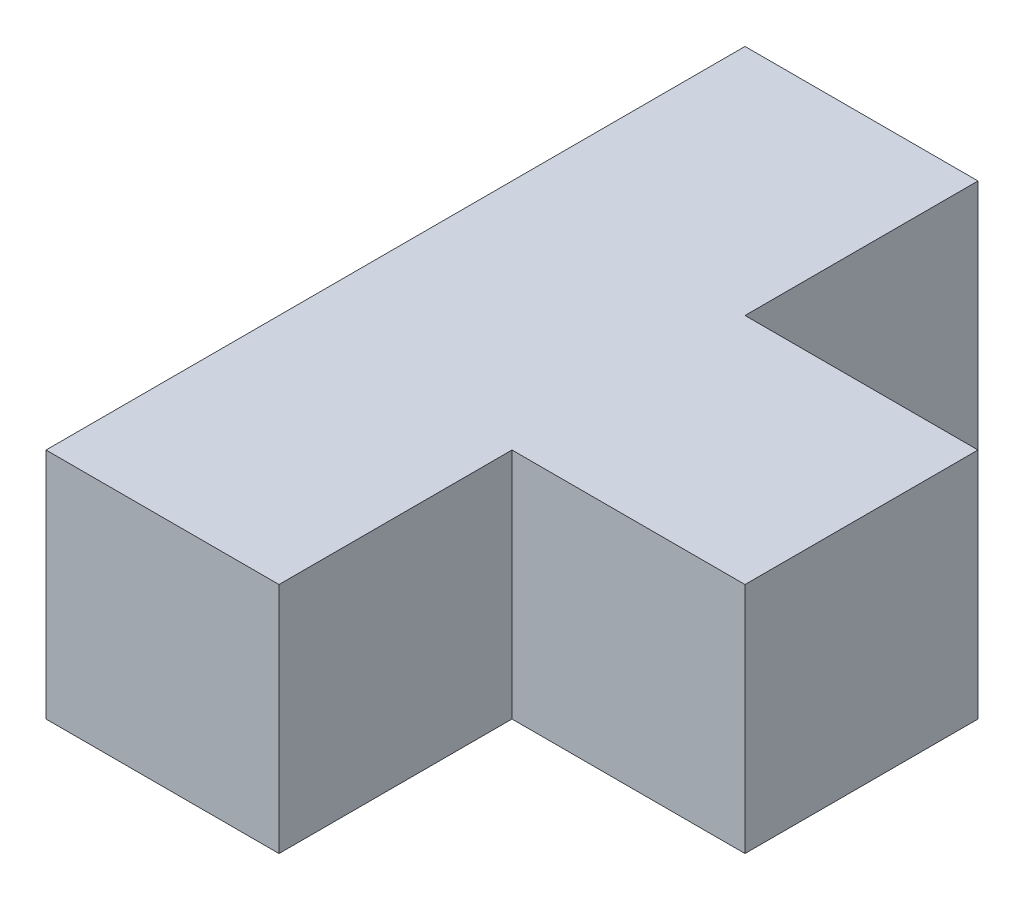
ISO-10303-21;
HEADER;
FILE_DESCRIPTION(('STEP AP214'),'2;1');
FILE_NAME('part.step','',(''),(''),'','','');
FILE_SCHEMA(('AUTOMOTIVE_DESIGN { 1 0 10303 214 1 1 1 1 }'));
ENDSEC;
DATA;
#1=APPLICATION_CONTEXT('core data for automotive mechanical design processes');
#2=APPLICATION_PROTOCOL_DEFINITION('international standard','automotive_design',2000,#1);
#3=PRODUCT_CONTEXT('',#1,'mechanical');
#4=PRODUCT('Part','Part','',(#3));
#5=PRODUCT_RELATED_PRODUCT_CATEGORY('part','',(#4));
#6=PRODUCT_DEFINITION_FORMATION('','',#4);
#7=PRODUCT_DEFINITION_CONTEXT('part definition',#1,'design');
#8=PRODUCT_DEFINITION('design','',#6,#7);
#9=PRODUCT_DEFINITION_SHAPE('','',#8);
#10=(LENGTH_UNIT() NAMED_UNIT(*) SI_UNIT(.MILLI.,.METRE.));
#11=(NAMED_UNIT(*) PLANE_ANGLE_UNIT() SI_UNIT($,.RADIAN.));
#12=(NAMED_UNIT(*) SI_UNIT($,.STERADIAN.) SOLID_ANGLE_UNIT());
#13=UNCERTAINTY_MEASURE_WITH_UNIT(LENGTH_MEASURE(1.E-05),#10,'distance_accuracy_value','');
#14=(GEOMETRIC_REPRESENTATION_CONTEXT(3) GLOBAL_UNCERTAINTY_ASSIGNED_CONTEXT((#13)) GLOBAL_UNIT_ASSIGNED_CONTEXT((#10,
#11,#12)) REPRESENTATION_CONTEXT('',''));
#15=CARTESIAN_POINT('',(0.,0.,0.));
#16=DIRECTION('',(0.,0.,1.));
#17=DIRECTION('',(1.,0.,0.));
#18=AXIS2_PLACEMENT_3D('',#15,#16,#17);
#19=CARTESIAN_POINT('',(0.,5000.,-7500.));
#20=DIRECTION('',(0.,0.,1.));
#21=DIRECTION('',(1.,0.,0.));
#22=AXIS2_PLACEMENT_3D('',#19,#20,#21);
#23=PLANE('',#22);
#24=DIRECTION('',(-1.,0.,0.));
#25=VECTOR('',#24,1.);
#26=CARTESIAN_POINT('',(0.,0.,-7500.));
#27=LINE('',#26,#25);
#28=CARTESIAN_POINT('',(0.,0.,-7500.));
#29=VERTEX_POINT('',#28);
#30=CARTESIAN_POINT('',(-5000.,0.,-7500.));
#31=VERTEX_POINT('',#30);
#32=EDGE_CURVE('E129',#29,#31,#27,.T.);
#33=ORIENTED_EDGE('',*,*,#32,.T.);
#34=DIRECTION('',(0.,-1.,0.));
#35=VECTOR('',#34,1.);
#36=CARTESIAN_POINT('',(-5000.,5000.,-7500.));
#37=LINE('',#36,#35);
#38=CARTESIAN_POINT('',(-5000.,5000.,-7500.));
#39=VERTEX_POINT('',#38);
#40=EDGE_CURVE('E11',#39,#31,#37,.T.);
#41=ORIENTED_EDGE('',*,*,#40,.F.);
#42=DIRECTION('',(-1.,0.,0.));
#43=VECTOR('',#42,1.);
#44=CARTESIAN_POINT('',(0.,5000.,-7500.));
#45=LINE('',#44,#43);
#46=CARTESIAN_POINT('',(0.,5000.,-7500.));
#47=VERTEX_POINT('',#46);
#48=EDGE_CURVE('E143',#47,#39,#45,.T.);
#49=ORIENTED_EDGE('',*,*,#48,.F.);
#50=DIRECTION('',(0.,-1.,0.));
#51=VECTOR('',#50,1.);
#52=CARTESIAN_POINT('',(0.,5000.,-7500.));
#53=LINE('',#52,#51);
#54=EDGE_CURVE('E125',#47,#29,#53,.T.);
#55=ORIENTED_EDGE('',*,*,#54,.T.);
#56=EDGE_LOOP('',(#33,#41,#49,#55));
#57=FACE_BOUND('',#56,.T.);
#58=ADVANCED_FACE('F33',(#57),#23,.F.);
#59=CARTESIAN_POINT('',(-5000.,5000.,-7500.));
#60=DIRECTION('',(1.,0.,0.));
#61=DIRECTION('',(0.,0.,-1.));
#62=AXIS2_PLACEMENT_3D('',#59,#60,#61);
#63=PLANE('',#62);
#64=DIRECTION('',(0.,0.,1.));
#65=VECTOR('',#64,1.);
#66=CARTESIAN_POINT('',(-5000.,0.,-7500.));
#67=LINE('',#66,#65);
#68=CARTESIAN_POINT('',(-5000.,0.,7500.));
#69=VERTEX_POINT('',#68);
#70=EDGE_CURVE('E132',#31,#69,#67,.T.);
#71=ORIENTED_EDGE('',*,*,#70,.T.);
#72=DIRECTION('',(0.,-1.,0.));
#73=VECTOR('',#72,1.);
#74=CARTESIAN_POINT('',(-5000.,5000.,7500.));
#75=LINE('',#74,#73);
#76=CARTESIAN_POINT('',(-5000.,5000.,7500.));
#77=VERTEX_POINT('',#76);
#78=EDGE_CURVE('E41',#77,#69,#75,.T.);
#79=ORIENTED_EDGE('',*,*,#78,.F.);
#80=DIRECTION('',(0.,0.,1.));
#81=VECTOR('',#80,1.);
#82=CARTESIAN_POINT('',(-5000.,5000.,-7500.));
#83=LINE('',#82,#81);
#84=EDGE_CURVE('E92',#39,#77,#83,.T.);
#85=ORIENTED_EDGE('',*,*,#84,.F.);
#86=ORIENTED_EDGE('',*,*,#40,.T.);
#87=EDGE_LOOP('',(#71,#79,#85,#86));
#88=FACE_BOUND('',#87,.T.);
#89=ADVANCED_FACE('F178',(#88),#63,.F.);
#90=CARTESIAN_POINT('',(-5000.,5000.,7500.));
#91=DIRECTION('',(0.,0.,-1.));
#92=DIRECTION('',(-1.,0.,0.));
#93=AXIS2_PLACEMENT_3D('',#90,#91,#92);
#94=PLANE('',#93);
#95=DIRECTION('',(1.,0.,0.));
#96=VECTOR('',#95,1.);
#97=CARTESIAN_POINT('',(-5000.,0.,7500.));
#98=LINE('',#97,#96);
#99=CARTESIAN_POINT('',(8.88178419700125E-13,0.,7500.));
#100=VERTEX_POINT('',#99);
#101=EDGE_CURVE('E134',#69,#100,#98,.T.);
#102=ORIENTED_EDGE('',*,*,#101,.T.);
#103=DIRECTION('',(0.,-1.,0.));
#104=VECTOR('',#103,1.);
#105=CARTESIAN_POINT('',(8.88178419700125E-13,5000.,7500.));
#106=LINE('',#105,#104);
#107=CARTESIAN_POINT('',(8.88178419700125E-13,5000.,7500.));
#108=VERTEX_POINT('',#107);
#109=EDGE_CURVE('E150',#108,#100,#106,.T.);
#110=ORIENTED_EDGE('',*,*,#109,.F.);
#111=DIRECTION('',(1.,0.,0.));
#112=VECTOR('',#111,1.);
#113=CARTESIAN_POINT('',(-5000.,5000.,7500.));
#114=LINE('',#113,#112);
#115=EDGE_CURVE('E158',#77,#108,#114,.T.);
#116=ORIENTED_EDGE('',*,*,#115,.F.);
#117=ORIENTED_EDGE('',*,*,#78,.T.);
#118=EDGE_LOOP('',(#102,#110,#116,#117));
#119=FACE_BOUND('',#118,.T.);
#120=ADVANCED_FACE('F156',(#119),#94,.F.);
#121=CARTESIAN_POINT('',(8.88178419700125E-13,5000.,7500.));
#122=DIRECTION('',(-1.,0.,0.));
#123=DIRECTION('',(0.,0.,1.));
#124=AXIS2_PLACEMENT_3D('',#121,#122,#123);
#125=PLANE('',#124);
#126=DIRECTION('',(0.,0.,-1.));
#127=VECTOR('',#126,1.);
#128=CARTESIAN_POINT('',(8.88178419700125E-13,0.,7500.));
#129=LINE('',#128,#127);
#130=CARTESIAN_POINT('',(8.88178419700125E-13,0.,2500.));
#131=VERTEX_POINT('',#130);
#132=EDGE_CURVE('E136',#100,#131,#129,.T.);
#133=ORIENTED_EDGE('',*,*,#132,.T.);
#134=DIRECTION('',(0.,-1.,0.));
#135=VECTOR('',#134,1.);
#136=CARTESIAN_POINT('',(8.88178419700125E-13,5000.,2500.));
#137=LINE('',#136,#135);
#138=CARTESIAN_POINT('',(8.88178419700125E-13,5000.,2500.));
#139=VERTEX_POINT('',#138);
#140=EDGE_CURVE('E147',#139,#131,#137,.T.);
#141=ORIENTED_EDGE('',*,*,#140,.F.);
#142=DIRECTION('',(0.,0.,-1.));
#143=VECTOR('',#142,1.);
#144=CARTESIAN_POINT('',(8.88178419700125E-13,5000.,7500.));
#145=LINE('',#144,#143);
#146=EDGE_CURVE('E170',#108,#139,#145,.T.);
#147=ORIENTED_EDGE('',*,*,#146,.F.);
#148=ORIENTED_EDGE('',*,*,#109,.T.);
#149=EDGE_LOOP('',(#133,#141,#147,#148));
#150=FACE_BOUND('',#149,.T.);
#151=ADVANCED_FACE('F166',(#150),#125,.F.);
#152=CARTESIAN_POINT('',(8.88178419700125E-13,5000.,2500.));
#153=DIRECTION('',(0.,0.,-1.));
#154=DIRECTION('',(-1.,0.,0.));
#155=AXIS2_PLACEMENT_3D('',#152,#153,#154);
#156=PLANE('',#155);
#157=DIRECTION('',(1.,0.,0.));
#158=VECTOR('',#157,1.);
#159=CARTESIAN_POINT('',(8.88178419700125E-13,0.,2500.));
#160=LINE('',#159,#158);
#161=CARTESIAN_POINT('',(5000.,0.,2500.));
#162=VERTEX_POINT('',#161);
#163=EDGE_CURVE('E138',#131,#162,#160,.T.);
#164=ORIENTED_EDGE('',*,*,#163,.T.);
#165=DIRECTION('',(0.,-1.,0.));
#166=VECTOR('',#165,1.);
#167=CARTESIAN_POINT('',(5000.,5000.,2500.));
#168=LINE('',#167,#166);
#169=CARTESIAN_POINT('',(5000.,5000.,2500.));
#170=VERTEX_POINT('',#169);
#171=EDGE_CURVE('E120',#170,#162,#168,.T.);
#172=ORIENTED_EDGE('',*,*,#171,.F.);
#173=DIRECTION('',(1.,0.,0.));
#174=VECTOR('',#173,1.);
#175=CARTESIAN_POINT('',(8.88178419700125E-13,5000.,2500.));
#176=LINE('',#175,#174);
#177=EDGE_CURVE('E111',#139,#170,#176,.T.);
#178=ORIENTED_EDGE('',*,*,#177,.F.);
#179=ORIENTED_EDGE('',*,*,#140,.T.);
#180=EDGE_LOOP('',(#164,#172,#178,#179));
#181=FACE_BOUND('',#180,.T.);
#182=ADVANCED_FACE('F169',(#181),#156,.F.);
#183=CARTESIAN_POINT('',(5000.,5000.,2500.));
#184=DIRECTION('',(-1.,0.,0.));
#185=DIRECTION('',(0.,0.,1.));
#186=AXIS2_PLACEMENT_3D('',#183,#184,#185);
#187=PLANE('',#186);
#188=DIRECTION('',(0.,0.,-1.));
#189=VECTOR('',#188,1.);
#190=CARTESIAN_POINT('',(5000.,0.,2500.));
#191=LINE('',#190,#189);
#192=CARTESIAN_POINT('',(5000.,0.,-2500.));
#193=VERTEX_POINT('',#192);
#194=EDGE_CURVE('E119',#162,#193,#191,.T.);
#195=ORIENTED_EDGE('',*,*,#194,.T.);
#196=DIRECTION('',(0.,-1.,0.));
#197=VECTOR('',#196,1.);
#198=CARTESIAN_POINT('',(5000.,5000.,-2500.));
#199=LINE('',#198,#197);
#200=CARTESIAN_POINT('',(5000.,5000.,-2500.));
#201=VERTEX_POINT('',#200);
#202=EDGE_CURVE('E116',#201,#193,#199,.T.);
#203=ORIENTED_EDGE('',*,*,#202,.F.);
#204=DIRECTION('',(0.,0.,-1.));
#205=VECTOR('',#204,1.);
#206=CARTESIAN_POINT('',(5000.,5000.,2500.));
#207=LINE('',#206,#205);
#208=EDGE_CURVE('E105',#170,#201,#207,.T.);
#209=ORIENTED_EDGE('',*,*,#208,.F.);
#210=ORIENTED_EDGE('',*,*,#171,.T.);
#211=EDGE_LOOP('',(#195,#203,#209,#210));
#212=FACE_BOUND('',#211,.T.);
#213=ADVANCED_FACE('F117',(#212),#187,.F.);
#214=CARTESIAN_POINT('',(5000.,5000.,-2500.));
#215=DIRECTION('',(0.,0.,1.));
#216=DIRECTION('',(1.,0.,0.));
#217=AXIS2_PLACEMENT_3D('',#214,#215,#216);
#218=PLANE('',#217);
#219=DIRECTION('',(-1.,0.,0.));
#220=VECTOR('',#219,1.);
#221=CARTESIAN_POINT('',(5000.,0.,-2500.));
#222=LINE('',#221,#220);
#223=CARTESIAN_POINT('',(0.,0.,-2500.));
#224=VERTEX_POINT('',#223);
#225=EDGE_CURVE('E78',#193,#224,#222,.T.);
#226=ORIENTED_EDGE('',*,*,#225,.T.);
#227=DIRECTION('',(0.,-1.,0.));
#228=VECTOR('',#227,1.);
#229=CARTESIAN_POINT('',(0.,5000.,-2500.));
#230=LINE('',#229,#228);
#231=CARTESIAN_POINT('',(0.,5000.,-2500.));
#232=VERTEX_POINT('',#231);
#233=EDGE_CURVE('E121',#232,#224,#230,.T.);
#234=ORIENTED_EDGE('',*,*,#233,.F.);
#235=DIRECTION('',(-1.,0.,0.));
#236=VECTOR('',#235,1.);
#237=CARTESIAN_POINT('',(5000.,5000.,-2500.));
#238=LINE('',#237,#236);
#239=EDGE_CURVE('E109',#201,#232,#238,.T.);
#240=ORIENTED_EDGE('',*,*,#239,.F.);
#241=ORIENTED_EDGE('',*,*,#202,.T.);
#242=EDGE_LOOP('',(#226,#234,#240,#241));
#243=FACE_BOUND('',#242,.T.);
#244=ADVANCED_FACE('F123',(#243),#218,.F.);
#245=CARTESIAN_POINT('',(0.,5000.,-2500.));
#246=DIRECTION('',(-1.,0.,0.));
#247=DIRECTION('',(0.,0.,1.));
#248=AXIS2_PLACEMENT_3D('',#245,#246,#247);
#249=PLANE('',#248);
#250=DIRECTION('',(0.,0.,-1.));
#251=VECTOR('',#250,1.);
#252=CARTESIAN_POINT('',(0.,0.,-2500.));
#253=LINE('',#252,#251);
#254=EDGE_CURVE('E84',#224,#29,#253,.T.);
#255=ORIENTED_EDGE('',*,*,#254,.T.);
#256=ORIENTED_EDGE('',*,*,#54,.F.);
#257=DIRECTION('',(0.,0.,-1.));
#258=VECTOR('',#257,1.);
#259=CARTESIAN_POINT('',(0.,5000.,-2500.));
#260=LINE('',#259,#258);
#261=EDGE_CURVE('E49',#232,#47,#260,.T.);
#262=ORIENTED_EDGE('',*,*,#261,.F.);
#263=ORIENTED_EDGE('',*,*,#233,.T.);
#264=EDGE_LOOP('',(#255,#256,#262,#263));
#265=FACE_BOUND('',#264,.T.);
#266=ADVANCED_FACE('F194',(#265),#249,.F.);
#267=CARTESIAN_POINT('',(0.,5000.,0.));
#268=DIRECTION('',(0.,1.,0.));
#269=DIRECTION('',(0.,0.,1.));
#270=AXIS2_PLACEMENT_3D('',#267,#268,#269);
#271=PLANE('',#270);
#272=ORIENTED_EDGE('',*,*,#48,.T.);
#273=ORIENTED_EDGE('',*,*,#84,.T.);
#274=ORIENTED_EDGE('',*,*,#115,.T.);
#275=ORIENTED_EDGE('',*,*,#146,.T.);
#276=ORIENTED_EDGE('',*,*,#177,.T.);
#277=ORIENTED_EDGE('',*,*,#208,.T.);
#278=ORIENTED_EDGE('',*,*,#239,.T.);
#279=ORIENTED_EDGE('',*,*,#261,.T.);
#280=EDGE_LOOP('',(#272,#273,#274,#275,#276,#277,#278,#279));
#281=FACE_BOUND('',#280,.T.);
#282=ADVANCED_FACE('F107',(#281),#271,.T.);
#283=CARTESIAN_POINT('',(0.,0.,0.));
#284=DIRECTION('',(0.,1.,0.));
#285=DIRECTION('',(0.,0.,1.));
#286=AXIS2_PLACEMENT_3D('',#283,#284,#285);
#287=PLANE('',#286);
#288=ORIENTED_EDGE('',*,*,#32,.F.);
#289=ORIENTED_EDGE('',*,*,#254,.F.);
#290=ORIENTED_EDGE('',*,*,#225,.F.);
#291=ORIENTED_EDGE('',*,*,#194,.F.);
#292=ORIENTED_EDGE('',*,*,#163,.F.);
#293=ORIENTED_EDGE('',*,*,#132,.F.);
#294=ORIENTED_EDGE('',*,*,#101,.F.);
#295=ORIENTED_EDGE('',*,*,#70,.F.);
#296=EDGE_LOOP('',(#288,#289,#290,#291,#292,#293,#294,#295));
#297=FACE_BOUND('',#296,.T.);
#298=ADVANCED_FACE('F162',(#297),#287,.F.);
#299=CLOSED_SHELL('',(#58,#89,#120,#151,#182,#213,#244,#266,#282,#298));
#300=MANIFOLD_SOLID_BREP('B2',#299);
#301=ADVANCED_BREP_SHAPE_REPRESENTATION('',(#18,#300),#14);
#302=SHAPE_DEFINITION_REPRESENTATION(#9,#301);
ENDSEC;
END-ISO-10303-21;
